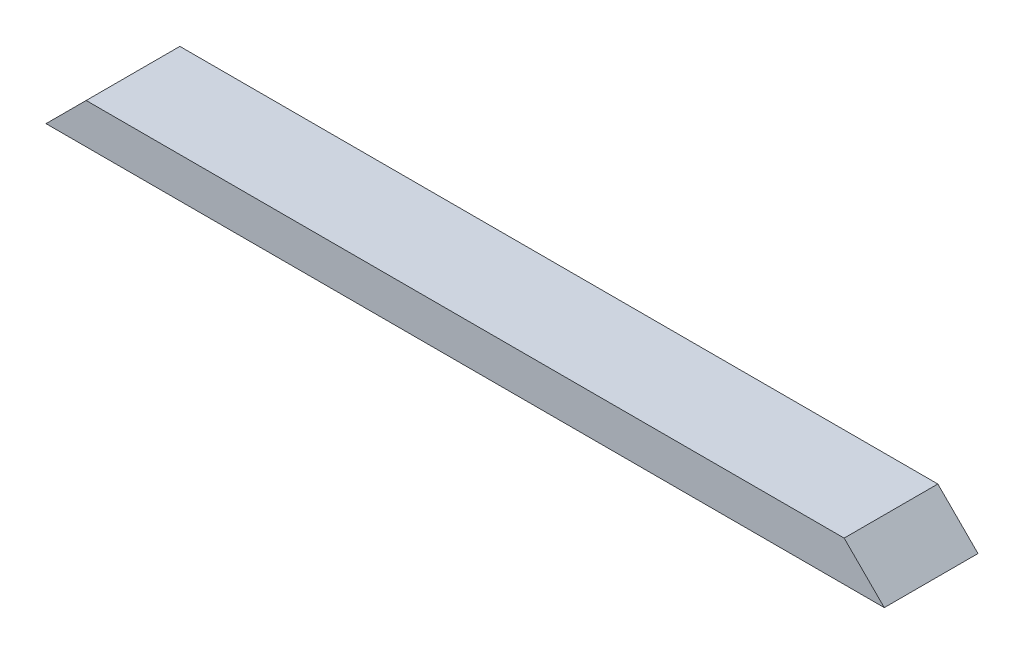
ISO-10303-21;
HEADER;
FILE_DESCRIPTION(('STEP AP214'),'2;1');
FILE_NAME('part.step','',(''),(''),'','','');
FILE_SCHEMA(('AUTOMOTIVE_DESIGN { 1 0 10303 214 1 1 1 1 }'));
ENDSEC;
DATA;
#1=APPLICATION_CONTEXT('core data for automotive mechanical design processes');
#2=APPLICATION_PROTOCOL_DEFINITION('international standard','automotive_design',2000,#1);
#3=PRODUCT_CONTEXT('',#1,'mechanical');
#4=PRODUCT('Part','Part','',(#3));
#5=PRODUCT_RELATED_PRODUCT_CATEGORY('part','',(#4));
#6=PRODUCT_DEFINITION_FORMATION('','',#4);
#7=PRODUCT_DEFINITION_CONTEXT('part definition',#1,'design');
#8=PRODUCT_DEFINITION('design','',#6,#7);
#9=PRODUCT_DEFINITION_SHAPE('','',#8);
#10=(LENGTH_UNIT() NAMED_UNIT(*) SI_UNIT(.MILLI.,.METRE.));
#11=(NAMED_UNIT(*) PLANE_ANGLE_UNIT() SI_UNIT($,.RADIAN.));
#12=(NAMED_UNIT(*) SI_UNIT($,.STERADIAN.) SOLID_ANGLE_UNIT());
#13=UNCERTAINTY_MEASURE_WITH_UNIT(LENGTH_MEASURE(1.E-05),#10,'distance_accuracy_value','');
#14=(GEOMETRIC_REPRESENTATION_CONTEXT(3) GLOBAL_UNCERTAINTY_ASSIGNED_CONTEXT((#13)) GLOBAL_UNIT_ASSIGNED_CONTEXT((#10,
#11,#12)) REPRESENTATION_CONTEXT('',''));
#15=CARTESIAN_POINT('',(0.,0.,0.));
#16=DIRECTION('',(0.,0.,1.));
#17=DIRECTION('',(1.,0.,0.));
#18=AXIS2_PLACEMENT_3D('',#15,#16,#17);
#19=CARTESIAN_POINT('',(0.,38.1,0.));
#20=DIRECTION('',(0.,0.,-1.));
#21=DIRECTION('',(-1.,0.,0.));
#22=AXIS2_PLACEMENT_3D('',#19,#20,#21);
#23=PLANE('',#22);
#24=DIRECTION('',(1.,0.,0.));
#25=VECTOR('',#24,1.);
#26=CARTESIAN_POINT('',(0.,38.1,0.));
#27=LINE('',#26,#25);
#28=CARTESIAN_POINT('',(38.1,38.1,0.));
#29=VERTEX_POINT('',#28);
#30=CARTESIAN_POINT('',(757.2756,38.1,0.));
#31=VERTEX_POINT('',#30);
#32=EDGE_CURVE('E47',#29,#31,#27,.T.);
#33=ORIENTED_EDGE('',*,*,#32,.F.);
#34=DIRECTION('',(0.707106781186547,0.707106781186547,0.));
#35=VECTOR('',#34,1.);
#36=CARTESIAN_POINT('',(0.,0.,0.));
#37=LINE('',#36,#35);
#38=CARTESIAN_POINT('',(0.,0.,0.));
#39=VERTEX_POINT('',#38);
#40=EDGE_CURVE('E82',#39,#29,#37,.T.);
#41=ORIENTED_EDGE('',*,*,#40,.F.);
#42=DIRECTION('',(1.,0.,0.));
#43=VECTOR('',#42,1.);
#44=CARTESIAN_POINT('',(0.,0.,0.));
#45=LINE('',#44,#43);
#46=CARTESIAN_POINT('',(795.3756,0.,0.));
#47=VERTEX_POINT('',#46);
#48=EDGE_CURVE('E87',#39,#47,#45,.T.);
#49=ORIENTED_EDGE('',*,*,#48,.T.);
#50=DIRECTION('',(0.707106781186548,-0.707106781186547,0.));
#51=VECTOR('',#50,1.);
#52=CARTESIAN_POINT('',(757.2756,38.1,0.));
#53=LINE('',#52,#51);
#54=EDGE_CURVE('E63',#31,#47,#53,.T.);
#55=ORIENTED_EDGE('',*,*,#54,.F.);
#56=EDGE_LOOP('',(#33,#41,#49,#55));
#57=FACE_BOUND('',#56,.T.);
#58=ADVANCED_FACE('F39',(#57),#23,.F.);
#59=CARTESIAN_POINT('',(0.,38.1,-88.9));
#60=DIRECTION('',(0.,0.,1.));
#61=DIRECTION('',(1.,0.,0.));
#62=AXIS2_PLACEMENT_3D('',#59,#60,#61);
#63=PLANE('',#62);
#64=DIRECTION('',(-1.,0.,0.));
#65=VECTOR('',#64,1.);
#66=CARTESIAN_POINT('',(0.,0.,-88.9));
#67=LINE('',#66,#65);
#68=CARTESIAN_POINT('',(795.3756,0.,-88.9));
#69=VERTEX_POINT('',#68);
#70=CARTESIAN_POINT('',(0.,0.,-88.9));
#71=VERTEX_POINT('',#70);
#72=EDGE_CURVE('E42',#69,#71,#67,.T.);
#73=ORIENTED_EDGE('',*,*,#72,.T.);
#74=DIRECTION('',(0.707106781186547,0.707106781186547,0.));
#75=VECTOR('',#74,1.);
#76=CARTESIAN_POINT('',(0.,0.,-88.9));
#77=LINE('',#76,#75);
#78=CARTESIAN_POINT('',(38.1,38.1,-88.9));
#79=VERTEX_POINT('',#78);
#80=EDGE_CURVE('E55',#71,#79,#77,.T.);
#81=ORIENTED_EDGE('',*,*,#80,.T.);
#82=DIRECTION('',(-1.,0.,0.));
#83=VECTOR('',#82,1.);
#84=CARTESIAN_POINT('',(0.,38.1,-88.9));
#85=LINE('',#84,#83);
#86=CARTESIAN_POINT('',(757.2756,38.1,-88.9));
#87=VERTEX_POINT('',#86);
#88=EDGE_CURVE('E11',#87,#79,#85,.T.);
#89=ORIENTED_EDGE('',*,*,#88,.F.);
#90=DIRECTION('',(0.707106781186548,-0.707106781186547,0.));
#91=VECTOR('',#90,1.);
#92=CARTESIAN_POINT('',(757.2756,38.1,-88.9));
#93=LINE('',#92,#91);
#94=EDGE_CURVE('E100',#87,#69,#93,.T.);
#95=ORIENTED_EDGE('',*,*,#94,.T.);
#96=EDGE_LOOP('',(#73,#81,#89,#95));
#97=FACE_BOUND('',#96,.T.);
#98=ADVANCED_FACE('F109',(#97),#63,.F.);
#99=CARTESIAN_POINT('',(0.,38.1,0.));
#100=DIRECTION('',(0.,-1.,0.));
#101=DIRECTION('',(0.,0.,-1.));
#102=AXIS2_PLACEMENT_3D('',#99,#100,#101);
#103=PLANE('',#102);
#104=ORIENTED_EDGE('',*,*,#88,.T.);
#105=DIRECTION('',(0.,0.,1.));
#106=VECTOR('',#105,1.);
#107=CARTESIAN_POINT('',(38.1,38.1,-88.9));
#108=LINE('',#107,#106);
#109=EDGE_CURVE('E88',#79,#29,#108,.T.);
#110=ORIENTED_EDGE('',*,*,#109,.T.);
#111=ORIENTED_EDGE('',*,*,#32,.T.);
#112=DIRECTION('',(0.,0.,1.));
#113=VECTOR('',#112,1.);
#114=CARTESIAN_POINT('',(757.2756,38.1,-88.9));
#115=LINE('',#114,#113);
#116=EDGE_CURVE('E103',#87,#31,#115,.T.);
#117=ORIENTED_EDGE('',*,*,#116,.F.);
#118=EDGE_LOOP('',(#104,#110,#111,#117));
#119=FACE_BOUND('',#118,.T.);
#120=ADVANCED_FACE('F112',(#119),#103,.F.);
#121=CARTESIAN_POINT('',(0.,0.,0.));
#122=DIRECTION('',(0.,-1.,0.));
#123=DIRECTION('',(0.,0.,-1.));
#124=AXIS2_PLACEMENT_3D('',#121,#122,#123);
#125=PLANE('',#124);
#126=DIRECTION('',(0.,0.,1.));
#127=VECTOR('',#126,1.);
#128=CARTESIAN_POINT('',(0.,0.,0.));
#129=LINE('',#128,#127);
#130=EDGE_CURVE('E79',#71,#39,#129,.T.);
#131=ORIENTED_EDGE('',*,*,#130,.F.);
#132=ORIENTED_EDGE('',*,*,#72,.F.);
#133=DIRECTION('',(0.,0.,-1.));
#134=VECTOR('',#133,1.);
#135=CARTESIAN_POINT('',(795.3756,0.,0.));
#136=LINE('',#135,#134);
#137=EDGE_CURVE('E96',#47,#69,#136,.T.);
#138=ORIENTED_EDGE('',*,*,#137,.F.);
#139=ORIENTED_EDGE('',*,*,#48,.F.);
#140=EDGE_LOOP('',(#131,#132,#138,#139));
#141=FACE_BOUND('',#140,.T.);
#142=ADVANCED_FACE('F95',(#141),#125,.T.);
#143=CARTESIAN_POINT('',(757.2756,38.1,-88.9));
#144=DIRECTION('',(-0.707106781186547,-0.707106781186548,0.));
#145=DIRECTION('',(0.707106781186548,-0.707106781186547,0.));
#146=AXIS2_PLACEMENT_3D('',#143,#144,#145);
#147=PLANE('',#146);
#148=ORIENTED_EDGE('',*,*,#54,.T.);
#149=ORIENTED_EDGE('',*,*,#137,.T.);
#150=ORIENTED_EDGE('',*,*,#94,.F.);
#151=ORIENTED_EDGE('',*,*,#116,.T.);
#152=EDGE_LOOP('',(#148,#149,#150,#151));
#153=FACE_BOUND('',#152,.T.);
#154=ADVANCED_FACE('F113',(#153),#147,.F.);
#155=CARTESIAN_POINT('',(0.,0.,-88.9));
#156=DIRECTION('',(0.707106781186547,-0.707106781186547,0.));
#157=DIRECTION('',(0.707106781186548,0.707106781186548,0.));
#158=AXIS2_PLACEMENT_3D('',#155,#156,#157);
#159=PLANE('',#158);
#160=ORIENTED_EDGE('',*,*,#40,.T.);
#161=ORIENTED_EDGE('',*,*,#109,.F.);
#162=ORIENTED_EDGE('',*,*,#80,.F.);
#163=ORIENTED_EDGE('',*,*,#130,.T.);
#164=EDGE_LOOP('',(#160,#161,#162,#163));
#165=FACE_BOUND('',#164,.T.);
#166=ADVANCED_FACE('F81',(#165),#159,.F.);
#167=CLOSED_SHELL('',(#58,#98,#120,#142,#154,#166));
#168=MANIFOLD_SOLID_BREP('B2',#167);
#169=ADVANCED_BREP_SHAPE_REPRESENTATION('',(#18,#168),#14);
#170=SHAPE_DEFINITION_REPRESENTATION(#9,#169);
ENDSEC;
END-ISO-10303-21;
